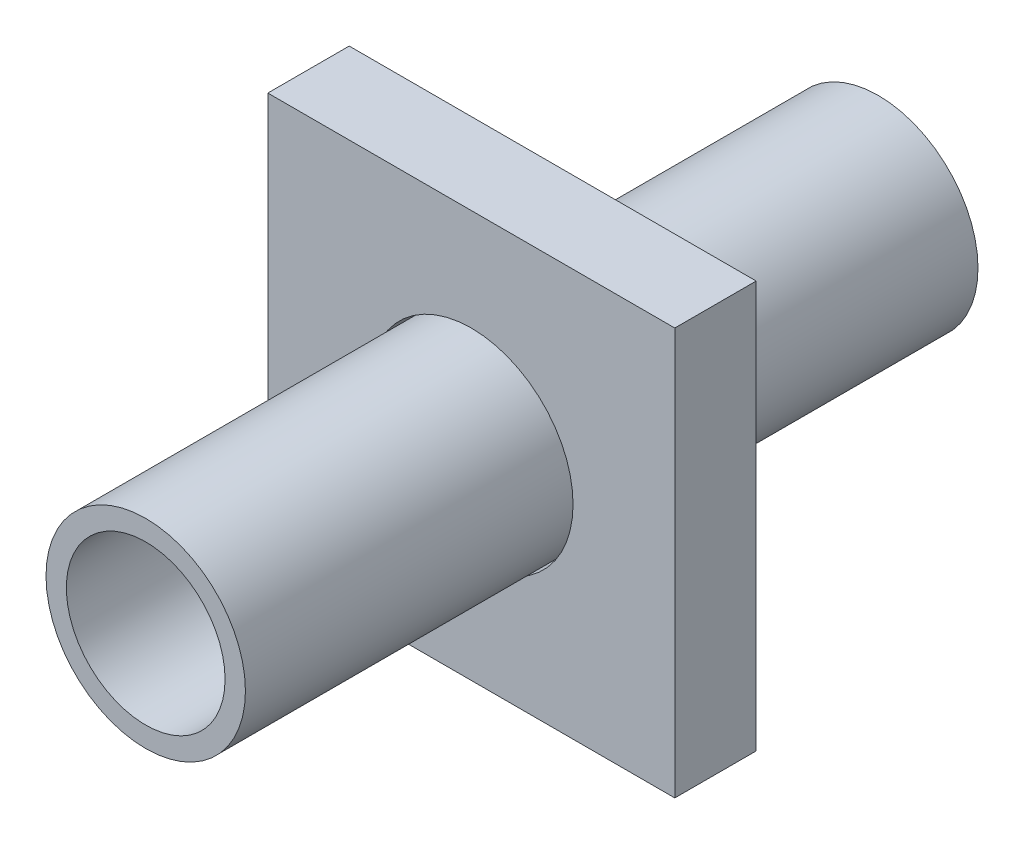
ISO-10303-21;
HEADER;
FILE_DESCRIPTION(('STEP AP214'),'2;1');
FILE_NAME('part.step','',(''),(''),'','','');
FILE_SCHEMA(('AUTOMOTIVE_DESIGN { 1 0 10303 214 1 1 1 1 }'));
ENDSEC;
DATA;
#1=APPLICATION_CONTEXT('core data for automotive mechanical design processes');
#2=APPLICATION_PROTOCOL_DEFINITION('international standard','automotive_design',2000,#1);
#3=PRODUCT_CONTEXT('',#1,'mechanical');
#4=PRODUCT('Part','Part','',(#3));
#5=PRODUCT_RELATED_PRODUCT_CATEGORY('part','',(#4));
#6=PRODUCT_DEFINITION_FORMATION('','',#4);
#7=PRODUCT_DEFINITION_CONTEXT('part definition',#1,'design');
#8=PRODUCT_DEFINITION('design','',#6,#7);
#9=PRODUCT_DEFINITION_SHAPE('','',#8);
#10=(LENGTH_UNIT() NAMED_UNIT(*) SI_UNIT(.MILLI.,.METRE.));
#11=(NAMED_UNIT(*) PLANE_ANGLE_UNIT() SI_UNIT($,.RADIAN.));
#12=(NAMED_UNIT(*) SI_UNIT($,.STERADIAN.) SOLID_ANGLE_UNIT());
#13=UNCERTAINTY_MEASURE_WITH_UNIT(LENGTH_MEASURE(1.E-05),#10,'distance_accuracy_value','');
#14=(GEOMETRIC_REPRESENTATION_CONTEXT(3) GLOBAL_UNCERTAINTY_ASSIGNED_CONTEXT((#13)) GLOBAL_UNIT_ASSIGNED_CONTEXT((#10,
#11,#12)) REPRESENTATION_CONTEXT('',''));
#15=CARTESIAN_POINT('',(0.,0.,0.));
#16=DIRECTION('',(0.,0.,1.));
#17=DIRECTION('',(1.,0.,0.));
#18=AXIS2_PLACEMENT_3D('',#15,#16,#17);
#19=CARTESIAN_POINT('',(0.,0.,-800.));
#20=DIRECTION('',(0.,0.,1.));
#21=DIRECTION('',(1.,0.,0.));
#22=AXIS2_PLACEMENT_3D('',#19,#20,#21);
#23=CYLINDRICAL_SURFACE('',#22,245.);
#24=CARTESIAN_POINT('',(0.,0.,-800.));
#25=DIRECTION('',(0.,0.,1.));
#26=DIRECTION('',(1.,0.,0.));
#27=AXIS2_PLACEMENT_3D('',#24,#25,#26);
#28=CIRCLE('',#27,245.);
#29=CARTESIAN_POINT('',(245.,0.,-800.));
#30=VERTEX_POINT('',#29);
#31=EDGE_CURVE('E12',#30,#30,#28,.T.);
#32=ORIENTED_EDGE('',*,*,#31,.T.);
#33=EDGE_LOOP('',(#32));
#34=FACE_BOUND('',#33,.T.);
#35=CARTESIAN_POINT('',(0.,0.,1000.));
#36=DIRECTION('',(0.,0.,1.));
#37=DIRECTION('',(1.,0.,0.));
#38=AXIS2_PLACEMENT_3D('',#35,#36,#37);
#39=CIRCLE('',#38,245.);
#40=CARTESIAN_POINT('',(245.,0.,1000.));
#41=VERTEX_POINT('',#40);
#42=EDGE_CURVE('E63',#41,#41,#39,.T.);
#43=ORIENTED_EDGE('',*,*,#42,.F.);
#44=EDGE_LOOP('',(#43));
#45=FACE_BOUND('',#44,.T.);
#46=ADVANCED_FACE('F53',(#34,#45),#23,.T.);
#47=CARTESIAN_POINT('',(0.,0.,-800.));
#48=DIRECTION('',(0.,0.,1.));
#49=DIRECTION('',(1.,0.,0.));
#50=AXIS2_PLACEMENT_3D('',#47,#48,#49);
#51=PLANE('',#50);
#52=CARTESIAN_POINT('',(0.,0.,-800.));
#53=DIRECTION('',(0.,0.,1.));
#54=DIRECTION('',(1.,0.,0.));
#55=AXIS2_PLACEMENT_3D('',#52,#53,#54);
#56=CIRCLE('',#55,195.);
#57=CARTESIAN_POINT('',(195.,0.,-800.));
#58=VERTEX_POINT('',#57);
#59=EDGE_CURVE('E59',#58,#58,#56,.T.);
#60=ORIENTED_EDGE('',*,*,#59,.T.);
#61=EDGE_LOOP('',(#60));
#62=FACE_BOUND('',#61,.T.);
#63=ORIENTED_EDGE('',*,*,#31,.F.);
#64=EDGE_LOOP('',(#63));
#65=FACE_BOUND('',#64,.T.);
#66=ADVANCED_FACE('F82',(#62,#65),#51,.F.);
#67=CARTESIAN_POINT('',(0.,0.,-800.));
#68=DIRECTION('',(0.,0.,1.));
#69=DIRECTION('',(1.,0.,0.));
#70=AXIS2_PLACEMENT_3D('',#67,#68,#69);
#71=CYLINDRICAL_SURFACE('',#70,195.);
#72=ORIENTED_EDGE('',*,*,#59,.F.);
#73=EDGE_LOOP('',(#72));
#74=FACE_BOUND('',#73,.T.);
#75=CARTESIAN_POINT('',(0.,0.,1000.));
#76=DIRECTION('',(0.,0.,1.));
#77=DIRECTION('',(1.,0.,0.));
#78=AXIS2_PLACEMENT_3D('',#75,#76,#77);
#79=CIRCLE('',#78,195.);
#80=CARTESIAN_POINT('',(195.,0.,1000.));
#81=VERTEX_POINT('',#80);
#82=EDGE_CURVE('E67',#81,#81,#79,.T.);
#83=ORIENTED_EDGE('',*,*,#82,.T.);
#84=EDGE_LOOP('',(#83));
#85=FACE_BOUND('',#84,.T.);
#86=ADVANCED_FACE('F73',(#74,#85),#71,.F.);
#87=CARTESIAN_POINT('',(0.,0.,1000.));
#88=DIRECTION('',(0.,0.,1.));
#89=DIRECTION('',(1.,0.,0.));
#90=AXIS2_PLACEMENT_3D('',#87,#88,#89);
#91=PLANE('',#90);
#92=ORIENTED_EDGE('',*,*,#42,.T.);
#93=EDGE_LOOP('',(#92));
#94=FACE_BOUND('',#93,.T.);
#95=ORIENTED_EDGE('',*,*,#82,.F.);
#96=EDGE_LOOP('',(#95));
#97=FACE_BOUND('',#96,.T.);
#98=ADVANCED_FACE('F75',(#94,#97),#91,.T.);
#99=CLOSED_SHELL('',(#46,#66,#86,#98));
#100=MANIFOLD_SOLID_BREP('B2',#99);
#101=CARTESIAN_POINT('',(0.,0.,200.));
#102=DIRECTION('',(0.,0.,1.));
#103=DIRECTION('',(1.,0.,0.));
#104=AXIS2_PLACEMENT_3D('',#101,#102,#103);
#105=PLANE('',#104);
#106=DIRECTION('',(0.,1.,0.));
#107=VECTOR('',#106,1.);
#108=CARTESIAN_POINT('',(500.,500.,200.));
#109=LINE('',#108,#107);
#110=CARTESIAN_POINT('',(500.,-500.,200.));
#111=VERTEX_POINT('',#110);
#112=CARTESIAN_POINT('',(500.,500.,200.));
#113=VERTEX_POINT('',#112);
#114=EDGE_CURVE('E167',#111,#113,#109,.T.);
#115=ORIENTED_EDGE('',*,*,#114,.T.);
#116=DIRECTION('',(-1.,0.,0.));
#117=VECTOR('',#116,1.);
#118=CARTESIAN_POINT('',(-500.,500.,200.));
#119=LINE('',#118,#117);
#120=CARTESIAN_POINT('',(-500.,500.,200.));
#121=VERTEX_POINT('',#120);
#122=EDGE_CURVE('E162',#113,#121,#119,.T.);
#123=ORIENTED_EDGE('',*,*,#122,.T.);
#124=DIRECTION('',(0.,-1.,0.));
#125=VECTOR('',#124,1.);
#126=CARTESIAN_POINT('',(-500.,500.,200.));
#127=LINE('',#126,#125);
#128=CARTESIAN_POINT('',(-500.,-500.,200.));
#129=VERTEX_POINT('',#128);
#130=EDGE_CURVE('E165',#121,#129,#127,.T.);
#131=ORIENTED_EDGE('',*,*,#130,.T.);
#132=DIRECTION('',(1.,0.,0.));
#133=VECTOR('',#132,1.);
#134=CARTESIAN_POINT('',(-500.,-500.,200.));
#135=LINE('',#134,#133);
#136=EDGE_CURVE('E132',#129,#111,#135,.T.);
#137=ORIENTED_EDGE('',*,*,#136,.T.);
#138=EDGE_LOOP('',(#115,#123,#131,#137));
#139=FACE_BOUND('',#138,.T.);
#140=CARTESIAN_POINT('',(0.,-1.11022302462516E-13,200.));
#141=DIRECTION('',(0.,0.,1.));
#142=DIRECTION('',(1.,0.,0.));
#143=AXIS2_PLACEMENT_3D('',#140,#141,#142);
#144=CIRCLE('',#143,250.);
#145=CARTESIAN_POINT('',(250.,-1.11022302462516E-13,200.));
#146=VERTEX_POINT('',#145);
#147=EDGE_CURVE('E182',#146,#146,#144,.T.);
#148=ORIENTED_EDGE('',*,*,#147,.F.);
#149=EDGE_LOOP('',(#148));
#150=FACE_BOUND('',#149,.T.);
#151=ADVANCED_FACE('F115',(#139,#150),#105,.T.);
#152=CARTESIAN_POINT('',(0.,0.,0.));
#153=DIRECTION('',(0.,0.,1.));
#154=DIRECTION('',(1.,0.,0.));
#155=AXIS2_PLACEMENT_3D('',#152,#153,#154);
#156=PLANE('',#155);
#157=DIRECTION('',(0.,1.,0.));
#158=VECTOR('',#157,1.);
#159=CARTESIAN_POINT('',(500.,500.,0.));
#160=LINE('',#159,#158);
#161=CARTESIAN_POINT('',(500.,-500.,0.));
#162=VERTEX_POINT('',#161);
#163=CARTESIAN_POINT('',(500.,500.,0.));
#164=VERTEX_POINT('',#163);
#165=EDGE_CURVE('E179',#162,#164,#160,.T.);
#166=ORIENTED_EDGE('',*,*,#165,.F.);
#167=DIRECTION('',(1.,0.,0.));
#168=VECTOR('',#167,1.);
#169=CARTESIAN_POINT('',(-500.,-500.,0.));
#170=LINE('',#169,#168);
#171=CARTESIAN_POINT('',(-500.,-500.,0.));
#172=VERTEX_POINT('',#171);
#173=EDGE_CURVE('E155',#172,#162,#170,.T.);
#174=ORIENTED_EDGE('',*,*,#173,.F.);
#175=DIRECTION('',(0.,-1.,0.));
#176=VECTOR('',#175,1.);
#177=CARTESIAN_POINT('',(-500.,500.,0.));
#178=LINE('',#177,#176);
#179=CARTESIAN_POINT('',(-500.,500.,0.));
#180=VERTEX_POINT('',#179);
#181=EDGE_CURVE('E149',#180,#172,#178,.T.);
#182=ORIENTED_EDGE('',*,*,#181,.F.);
#183=DIRECTION('',(-1.,0.,0.));
#184=VECTOR('',#183,1.);
#185=CARTESIAN_POINT('',(-500.,500.,0.));
#186=LINE('',#185,#184);
#187=EDGE_CURVE('E171',#164,#180,#186,.T.);
#188=ORIENTED_EDGE('',*,*,#187,.F.);
#189=EDGE_LOOP('',(#166,#174,#182,#188));
#190=FACE_BOUND('',#189,.T.);
#191=CARTESIAN_POINT('',(0.,-1.11022302462516E-13,0.));
#192=DIRECTION('',(0.,0.,1.));
#193=DIRECTION('',(1.,0.,0.));
#194=AXIS2_PLACEMENT_3D('',#191,#192,#193);
#195=CIRCLE('',#194,250.);
#196=CARTESIAN_POINT('',(250.,-1.11022302462516E-13,0.));
#197=VERTEX_POINT('',#196);
#198=EDGE_CURVE('E194',#197,#197,#195,.T.);
#199=ORIENTED_EDGE('',*,*,#198,.T.);
#200=EDGE_LOOP('',(#199));
#201=FACE_BOUND('',#200,.T.);
#202=ADVANCED_FACE('F190',(#190,#201),#156,.F.);
#203=CARTESIAN_POINT('',(500.,500.,200.));
#204=DIRECTION('',(-1.,0.,0.));
#205=DIRECTION('',(0.,-1.,0.));
#206=AXIS2_PLACEMENT_3D('',#203,#204,#205);
#207=PLANE('',#206);
#208=ORIENTED_EDGE('',*,*,#165,.T.);
#209=DIRECTION('',(0.,0.,-1.));
#210=VECTOR('',#209,1.);
#211=CARTESIAN_POINT('',(500.,500.,200.));
#212=LINE('',#211,#210);
#213=EDGE_CURVE('E51',#113,#164,#212,.T.);
#214=ORIENTED_EDGE('',*,*,#213,.F.);
#215=ORIENTED_EDGE('',*,*,#114,.F.);
#216=DIRECTION('',(0.,0.,-1.));
#217=VECTOR('',#216,1.);
#218=CARTESIAN_POINT('',(500.,-500.,200.));
#219=LINE('',#218,#217);
#220=EDGE_CURVE('E175',#111,#162,#219,.T.);
#221=ORIENTED_EDGE('',*,*,#220,.T.);
#222=EDGE_LOOP('',(#208,#214,#215,#221));
#223=FACE_BOUND('',#222,.T.);
#224=ADVANCED_FACE('F117',(#223),#207,.F.);
#225=CARTESIAN_POINT('',(-500.,500.,200.));
#226=DIRECTION('',(0.,-1.,0.));
#227=DIRECTION('',(0.,0.,-1.));
#228=AXIS2_PLACEMENT_3D('',#225,#226,#227);
#229=PLANE('',#228);
#230=ORIENTED_EDGE('',*,*,#187,.T.);
#231=DIRECTION('',(0.,0.,-1.));
#232=VECTOR('',#231,1.);
#233=CARTESIAN_POINT('',(-500.,500.,200.));
#234=LINE('',#233,#232);
#235=EDGE_CURVE('E124',#121,#180,#234,.T.);
#236=ORIENTED_EDGE('',*,*,#235,.F.);
#237=ORIENTED_EDGE('',*,*,#122,.F.);
#238=ORIENTED_EDGE('',*,*,#213,.T.);
#239=EDGE_LOOP('',(#230,#236,#237,#238));
#240=FACE_BOUND('',#239,.T.);
#241=ADVANCED_FACE('F170',(#240),#229,.F.);
#242=CARTESIAN_POINT('',(-500.,500.,200.));
#243=DIRECTION('',(1.,0.,0.));
#244=DIRECTION('',(0.,1.,0.));
#245=AXIS2_PLACEMENT_3D('',#242,#243,#244);
#246=PLANE('',#245);
#247=ORIENTED_EDGE('',*,*,#181,.T.);
#248=DIRECTION('',(0.,0.,-1.));
#249=VECTOR('',#248,1.);
#250=CARTESIAN_POINT('',(-500.,-500.,200.));
#251=LINE('',#250,#249);
#252=EDGE_CURVE('E172',#129,#172,#251,.T.);
#253=ORIENTED_EDGE('',*,*,#252,.F.);
#254=ORIENTED_EDGE('',*,*,#130,.F.);
#255=ORIENTED_EDGE('',*,*,#235,.T.);
#256=EDGE_LOOP('',(#247,#253,#254,#255));
#257=FACE_BOUND('',#256,.T.);
#258=ADVANCED_FACE('F173',(#257),#246,.F.);
#259=CARTESIAN_POINT('',(-500.,-500.,200.));
#260=DIRECTION('',(0.,1.,0.));
#261=DIRECTION('',(0.,0.,1.));
#262=AXIS2_PLACEMENT_3D('',#259,#260,#261);
#263=PLANE('',#262);
#264=ORIENTED_EDGE('',*,*,#173,.T.);
#265=ORIENTED_EDGE('',*,*,#220,.F.);
#266=ORIENTED_EDGE('',*,*,#136,.F.);
#267=ORIENTED_EDGE('',*,*,#252,.T.);
#268=EDGE_LOOP('',(#264,#265,#266,#267));
#269=FACE_BOUND('',#268,.T.);
#270=ADVANCED_FACE('F187',(#269),#263,.F.);
#271=CARTESIAN_POINT('',(0.,-1.11022302462516E-13,200.));
#272=DIRECTION('',(0.,0.,-1.));
#273=DIRECTION('',(-1.,0.,0.));
#274=AXIS2_PLACEMENT_3D('',#271,#272,#273);
#275=CYLINDRICAL_SURFACE('',#274,250.);
#276=ORIENTED_EDGE('',*,*,#147,.T.);
#277=EDGE_LOOP('',(#276));
#278=FACE_BOUND('',#277,.T.);
#279=ORIENTED_EDGE('',*,*,#198,.F.);
#280=EDGE_LOOP('',(#279));
#281=FACE_BOUND('',#280,.T.);
#282=ADVANCED_FACE('F200',(#278,#281),#275,.F.);
#283=CLOSED_SHELL('',(#151,#202,#224,#241,#258,#270,#282));
#284=MANIFOLD_SOLID_BREP('B7',#283);
#285=ADVANCED_BREP_SHAPE_REPRESENTATION('',(#18,#100,#284),#14);
#286=SHAPE_DEFINITION_REPRESENTATION(#9,#285);
ENDSEC;
END-ISO-10303-21;
